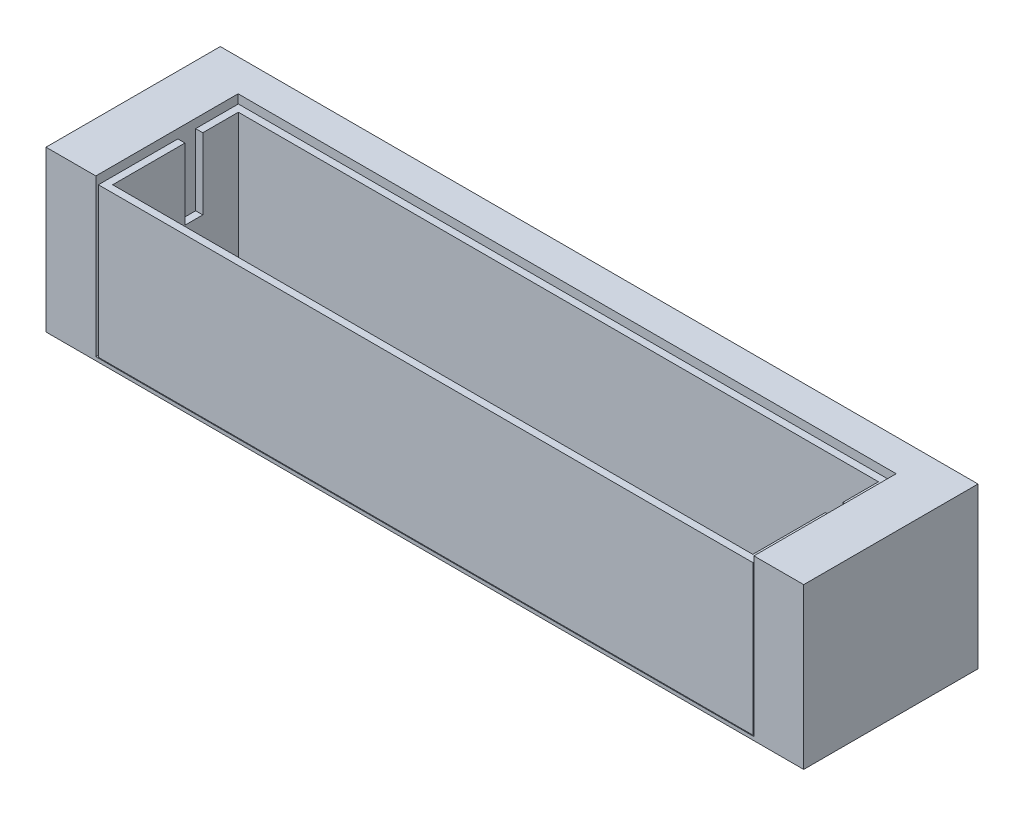
ISO-10303-21;
HEADER;
FILE_DESCRIPTION(('STEP AP214'),'2;1');
FILE_NAME('part.step','',(''),(''),'','','');
FILE_SCHEMA(('AUTOMOTIVE_DESIGN { 1 0 10303 214 1 1 1 1 }'));
ENDSEC;
DATA;
#1=APPLICATION_CONTEXT('core data for automotive mechanical design processes');
#2=APPLICATION_PROTOCOL_DEFINITION('international standard','automotive_design',2000,#1);
#3=PRODUCT_CONTEXT('',#1,'mechanical');
#4=PRODUCT('Part','Part','',(#3));
#5=PRODUCT_RELATED_PRODUCT_CATEGORY('part','',(#4));
#6=PRODUCT_DEFINITION_FORMATION('','',#4);
#7=PRODUCT_DEFINITION_CONTEXT('part definition',#1,'design');
#8=PRODUCT_DEFINITION('design','',#6,#7);
#9=PRODUCT_DEFINITION_SHAPE('','',#8);
#10=(LENGTH_UNIT() NAMED_UNIT(*) SI_UNIT(.MILLI.,.METRE.));
#11=(NAMED_UNIT(*) PLANE_ANGLE_UNIT() SI_UNIT($,.RADIAN.));
#12=(NAMED_UNIT(*) SI_UNIT($,.STERADIAN.) SOLID_ANGLE_UNIT());
#13=UNCERTAINTY_MEASURE_WITH_UNIT(LENGTH_MEASURE(1.E-05),#10,'distance_accuracy_value','');
#14=(GEOMETRIC_REPRESENTATION_CONTEXT(3) GLOBAL_UNCERTAINTY_ASSIGNED_CONTEXT((#13)) GLOBAL_UNIT_ASSIGNED_CONTEXT((#10,
#11,#12)) REPRESENTATION_CONTEXT('',''));
#15=CARTESIAN_POINT('',(0.,0.,0.));
#16=DIRECTION('',(0.,0.,1.));
#17=DIRECTION('',(1.,0.,0.));
#18=AXIS2_PLACEMENT_3D('',#15,#16,#17);
#19=CARTESIAN_POINT('',(-9.00781996408617,18.5,4.3850582673517));
#20=DIRECTION('',(0.,1.,0.));
#21=DIRECTION('',(0.,0.,1.));
#22=AXIS2_PLACEMENT_3D('',#19,#20,#21);
#23=PLANE('',#22);
#24=DIRECTION('',(0.,0.,1.));
#25=VECTOR('',#24,1.);
#26=CARTESIAN_POINT('',(8.99781996408616,18.5,4.3850582673517));
#27=LINE('',#26,#25);
#28=CARTESIAN_POINT('',(8.99781996408616,18.5,4.3950582673517));
#29=VERTEX_POINT('',#28);
#30=CARTESIAN_POINT('',(8.99781996408616,18.5,7.92813548410465));
#31=VERTEX_POINT('',#30);
#32=EDGE_CURVE('E188',#29,#31,#27,.T.);
#33=ORIENTED_EDGE('',*,*,#32,.F.);
#34=DIRECTION('',(1.,0.,0.));
#35=VECTOR('',#34,1.);
#36=CARTESIAN_POINT('',(-9.00781996408616,18.5,4.3950582673517));
#37=LINE('',#36,#35);
#38=CARTESIAN_POINT('',(-8.99781996408617,18.5,4.3950582673517));
#39=VERTEX_POINT('',#38);
#40=EDGE_CURVE('E20',#39,#29,#37,.T.);
#41=ORIENTED_EDGE('',*,*,#40,.F.);
#42=DIRECTION('',(0.,0.,-1.));
#43=VECTOR('',#42,1.);
#44=CARTESIAN_POINT('',(-8.99781996408617,18.5,7.93813548410465));
#45=LINE('',#44,#43);
#46=CARTESIAN_POINT('',(-8.99781996408617,18.5,7.92813548410465));
#47=VERTEX_POINT('',#46);
#48=EDGE_CURVE('E200',#47,#39,#45,.T.);
#49=ORIENTED_EDGE('',*,*,#48,.F.);
#50=DIRECTION('',(-1.,0.,0.));
#51=VECTOR('',#50,1.);
#52=CARTESIAN_POINT('',(9.00781996408616,18.5,7.92813548410465));
#53=LINE('',#52,#51);
#54=EDGE_CURVE('E176',#31,#47,#53,.T.);
#55=ORIENTED_EDGE('',*,*,#54,.F.);
#56=EDGE_LOOP('',(#33,#41,#49,#55));
#57=FACE_BOUND('',#56,.T.);
#58=ADVANCED_FACE('F17',(#57),#23,.T.);
#59=CARTESIAN_POINT('',(-9.00781996408616,18.49,4.3950582673517));
#60=DIRECTION('',(0.,0.,1.));
#61=DIRECTION('',(1.,0.,0.));
#62=AXIS2_PLACEMENT_3D('',#59,#60,#61);
#63=PLANE('',#62);
#64=DIRECTION('',(1.,0.,0.));
#65=VECTOR('',#64,1.);
#66=CARTESIAN_POINT('',(-9.20781996408616,22.5,4.3950582673517));
#67=LINE('',#66,#65);
#68=CARTESIAN_POINT('',(-8.99781996408617,22.5,4.3950582673517));
#69=VERTEX_POINT('',#68);
#70=CARTESIAN_POINT('',(8.99781996408616,22.5,4.3950582673517));
#71=VERTEX_POINT('',#70);
#72=EDGE_CURVE('E223',#69,#71,#67,.T.);
#73=ORIENTED_EDGE('',*,*,#72,.F.);
#74=DIRECTION('',(0.,1.,0.));
#75=VECTOR('',#74,1.);
#76=CARTESIAN_POINT('',(-8.99781996408617,18.49,4.3950582673517));
#77=LINE('',#76,#75);
#78=EDGE_CURVE('E186',#39,#69,#77,.T.);
#79=ORIENTED_EDGE('',*,*,#78,.F.);
#80=ORIENTED_EDGE('',*,*,#40,.T.);
#81=DIRECTION('',(0.,1.,0.));
#82=VECTOR('',#81,1.);
#83=CARTESIAN_POINT('',(8.99781996408616,18.49,4.3950582673517));
#84=LINE('',#83,#82);
#85=EDGE_CURVE('E184',#71,#29,#84,.F.);
#86=ORIENTED_EDGE('',*,*,#85,.F.);
#87=EDGE_LOOP('',(#73,#79,#80,#86));
#88=FACE_BOUND('',#87,.T.);
#89=ADVANCED_FACE('F182',(#88),#63,.T.);
#90=CARTESIAN_POINT('',(8.99781996408616,18.49,4.3850582673517));
#91=DIRECTION('',(-1.,0.,0.));
#92=DIRECTION('',(0.,0.,1.));
#93=AXIS2_PLACEMENT_3D('',#90,#91,#92);
#94=PLANE('',#93);
#95=ORIENTED_EDGE('',*,*,#32,.T.);
#96=DIRECTION('',(0.,1.,0.));
#97=VECTOR('',#96,1.);
#98=CARTESIAN_POINT('',(8.99781996408616,18.49,7.92813548410465));
#99=LINE('',#98,#97);
#100=CARTESIAN_POINT('',(8.99781996408616,22.5,7.92813548410465));
#101=VERTEX_POINT('',#100);
#102=EDGE_CURVE('E198',#101,#31,#99,.F.);
#103=ORIENTED_EDGE('',*,*,#102,.F.);
#104=DIRECTION('',(0.,0.,1.));
#105=VECTOR('',#104,1.);
#106=CARTESIAN_POINT('',(8.99781996408616,22.5,5.8850582673517));
#107=LINE('',#106,#105);
#108=CARTESIAN_POINT('',(8.99781996408616,22.5,5.8950582673517));
#109=VERTEX_POINT('',#108);
#110=EDGE_CURVE('E249',#109,#101,#107,.T.);
#111=ORIENTED_EDGE('',*,*,#110,.F.);
#112=DIRECTION('',(0.,1.,0.));
#113=VECTOR('',#112,1.);
#114=CARTESIAN_POINT('',(8.99781996408616,20.49,5.8950582673517));
#115=LINE('',#114,#113);
#116=CARTESIAN_POINT('',(8.99781996408616,20.5,5.8950582673517));
#117=VERTEX_POINT('',#116);
#118=EDGE_CURVE('E244',#117,#109,#115,.T.);
#119=ORIENTED_EDGE('',*,*,#118,.F.);
#120=DIRECTION('',(0.,0.,1.));
#121=VECTOR('',#120,1.);
#122=CARTESIAN_POINT('',(8.99781996408616,20.5,5.3850582673517));
#123=LINE('',#122,#121);
#124=CARTESIAN_POINT('',(8.99781996408616,20.5,5.3950582673517));
#125=VERTEX_POINT('',#124);
#126=EDGE_CURVE('E239',#125,#117,#123,.T.);
#127=ORIENTED_EDGE('',*,*,#126,.F.);
#128=DIRECTION('',(0.,1.,0.));
#129=VECTOR('',#128,1.);
#130=CARTESIAN_POINT('',(8.99781996408616,20.49,5.3950582673517));
#131=LINE('',#130,#129);
#132=CARTESIAN_POINT('',(8.99781996408616,22.5,5.3950582673517));
#133=VERTEX_POINT('',#132);
#134=EDGE_CURVE('E234',#133,#125,#131,.F.);
#135=ORIENTED_EDGE('',*,*,#134,.F.);
#136=DIRECTION('',(0.,0.,1.));
#137=VECTOR('',#136,1.);
#138=CARTESIAN_POINT('',(8.99781996408616,22.5,4.1850582673517));
#139=LINE('',#138,#137);
#140=EDGE_CURVE('E194',#71,#133,#139,.T.);
#141=ORIENTED_EDGE('',*,*,#140,.F.);
#142=ORIENTED_EDGE('',*,*,#85,.T.);
#143=EDGE_LOOP('',(#95,#103,#111,#119,#127,#135,#141,#142));
#144=FACE_BOUND('',#143,.T.);
#145=ADVANCED_FACE('F192',(#144),#94,.T.);
#146=CARTESIAN_POINT('',(9.00781996408616,18.49,7.92813548410465));
#147=DIRECTION('',(0.,0.,-1.));
#148=DIRECTION('',(-1.,0.,0.));
#149=AXIS2_PLACEMENT_3D('',#146,#147,#148);
#150=PLANE('',#149);
#151=DIRECTION('',(1.,0.,0.));
#152=VECTOR('',#151,1.);
#153=CARTESIAN_POINT('',(-9.20781996408616,22.5,7.92813548410465));
#154=LINE('',#153,#152);
#155=CARTESIAN_POINT('',(-8.99781996408617,22.5,7.92813548410465));
#156=VERTEX_POINT('',#155);
#157=EDGE_CURVE('E252',#101,#156,#154,.F.);
#158=ORIENTED_EDGE('',*,*,#157,.F.);
#159=ORIENTED_EDGE('',*,*,#102,.T.);
#160=ORIENTED_EDGE('',*,*,#54,.T.);
#161=DIRECTION('',(0.,1.,0.));
#162=VECTOR('',#161,1.);
#163=CARTESIAN_POINT('',(-8.99781996408617,18.49,7.92813548410465));
#164=LINE('',#163,#162);
#165=EDGE_CURVE('E203',#156,#47,#164,.F.);
#166=ORIENTED_EDGE('',*,*,#165,.F.);
#167=EDGE_LOOP('',(#158,#159,#160,#166));
#168=FACE_BOUND('',#167,.T.);
#169=ADVANCED_FACE('F481',(#168),#150,.T.);
#170=CARTESIAN_POINT('',(-8.99781996408617,18.49,7.93813548410465));
#171=DIRECTION('',(1.,0.,0.));
#172=DIRECTION('',(0.,0.,-1.));
#173=AXIS2_PLACEMENT_3D('',#170,#171,#172);
#174=PLANE('',#173);
#175=DIRECTION('',(0.,0.,1.));
#176=VECTOR('',#175,1.);
#177=CARTESIAN_POINT('',(-8.99781996408617,22.5,5.8850582673517));
#178=LINE('',#177,#176);
#179=CARTESIAN_POINT('',(-8.99781996408617,22.5,5.8950582673517));
#180=VERTEX_POINT('',#179);
#181=EDGE_CURVE('E255',#156,#180,#178,.F.);
#182=ORIENTED_EDGE('',*,*,#181,.F.);
#183=ORIENTED_EDGE('',*,*,#165,.T.);
#184=ORIENTED_EDGE('',*,*,#48,.T.);
#185=ORIENTED_EDGE('',*,*,#78,.T.);
#186=DIRECTION('',(0.,0.,1.));
#187=VECTOR('',#186,1.);
#188=CARTESIAN_POINT('',(-8.99781996408617,22.5,4.1850582673517));
#189=LINE('',#188,#187);
#190=CARTESIAN_POINT('',(-8.99781996408617,22.5,5.3950582673517));
#191=VERTEX_POINT('',#190);
#192=EDGE_CURVE('E220',#191,#69,#189,.F.);
#193=ORIENTED_EDGE('',*,*,#192,.F.);
#194=DIRECTION('',(0.,1.,0.));
#195=VECTOR('',#194,1.);
#196=CARTESIAN_POINT('',(-8.99781996408617,20.49,5.3950582673517));
#197=LINE('',#196,#195);
#198=CARTESIAN_POINT('',(-8.99781996408617,20.5,5.3950582673517));
#199=VERTEX_POINT('',#198);
#200=EDGE_CURVE('E217',#199,#191,#197,.T.);
#201=ORIENTED_EDGE('',*,*,#200,.F.);
#202=DIRECTION('',(0.,0.,1.));
#203=VECTOR('',#202,1.);
#204=CARTESIAN_POINT('',(-8.99781996408617,20.5,5.3850582673517));
#205=LINE('',#204,#203);
#206=CARTESIAN_POINT('',(-8.99781996408617,20.5,5.8950582673517));
#207=VERTEX_POINT('',#206);
#208=EDGE_CURVE('E209',#207,#199,#205,.F.);
#209=ORIENTED_EDGE('',*,*,#208,.F.);
#210=DIRECTION('',(0.,1.,0.));
#211=VECTOR('',#210,1.);
#212=CARTESIAN_POINT('',(-8.99781996408617,20.49,5.8950582673517));
#213=LINE('',#212,#211);
#214=EDGE_CURVE('E206',#180,#207,#213,.F.);
#215=ORIENTED_EDGE('',*,*,#214,.F.);
#216=EDGE_LOOP('',(#182,#183,#184,#185,#193,#201,#209,#215));
#217=FACE_BOUND('',#216,.T.);
#218=ADVANCED_FACE('F477',(#217),#174,.T.);
#219=CARTESIAN_POINT('',(-8.98781996408616,20.49,5.8950582673517));
#220=DIRECTION('',(0.,0.,-1.));
#221=DIRECTION('',(-1.,0.,0.));
#222=AXIS2_PLACEMENT_3D('',#219,#220,#221);
#223=PLANE('',#222);
#224=DIRECTION('',(1.,0.,0.));
#225=VECTOR('',#224,1.);
#226=CARTESIAN_POINT('',(-9.20781996408616,22.5,5.8950582673517));
#227=LINE('',#226,#225);
#228=CARTESIAN_POINT('',(-9.19781996408616,22.5,5.8950582673517));
#229=VERTEX_POINT('',#228);
#230=EDGE_CURVE('E258',#180,#229,#227,.F.);
#231=ORIENTED_EDGE('',*,*,#230,.F.);
#232=ORIENTED_EDGE('',*,*,#214,.T.);
#233=DIRECTION('',(1.,0.,0.));
#234=VECTOR('',#233,1.);
#235=CARTESIAN_POINT('',(-9.20781996408616,20.5,5.8950582673517));
#236=LINE('',#235,#234);
#237=CARTESIAN_POINT('',(-9.19781996408616,20.5,5.8950582673517));
#238=VERTEX_POINT('',#237);
#239=EDGE_CURVE('E211',#238,#207,#236,.T.);
#240=ORIENTED_EDGE('',*,*,#239,.F.);
#241=DIRECTION('',(0.,1.,0.));
#242=VECTOR('',#241,1.);
#243=CARTESIAN_POINT('',(-9.19781996408616,18.29,5.8950582673517));
#244=LINE('',#243,#242);
#245=EDGE_CURVE('E266',#229,#238,#244,.F.);
#246=ORIENTED_EDGE('',*,*,#245,.F.);
#247=EDGE_LOOP('',(#231,#232,#240,#246));
#248=FACE_BOUND('',#247,.T.);
#249=ADVANCED_FACE('F473',(#248),#223,.T.);
#250=CARTESIAN_POINT('',(-9.20781996408616,20.5,5.3850582673517));
#251=DIRECTION('',(0.,1.,0.));
#252=DIRECTION('',(0.,0.,1.));
#253=AXIS2_PLACEMENT_3D('',#250,#251,#252);
#254=PLANE('',#253);
#255=DIRECTION('',(0.,0.,1.));
#256=VECTOR('',#255,1.);
#257=CARTESIAN_POINT('',(-9.19781996408616,20.5,4.1850582673517));
#258=LINE('',#257,#256);
#259=CARTESIAN_POINT('',(-9.19781996408616,20.5,5.3950582673517));
#260=VERTEX_POINT('',#259);
#261=EDGE_CURVE('E269',#238,#260,#258,.F.);
#262=ORIENTED_EDGE('',*,*,#261,.F.);
#263=ORIENTED_EDGE('',*,*,#239,.T.);
#264=ORIENTED_EDGE('',*,*,#208,.T.);
#265=DIRECTION('',(1.,0.,0.));
#266=VECTOR('',#265,1.);
#267=CARTESIAN_POINT('',(-9.20781996408616,20.5,5.3950582673517));
#268=LINE('',#267,#266);
#269=EDGE_CURVE('E214',#260,#199,#268,.T.);
#270=ORIENTED_EDGE('',*,*,#269,.F.);
#271=EDGE_LOOP('',(#262,#263,#264,#270));
#272=FACE_BOUND('',#271,.T.);
#273=ADVANCED_FACE('F469',(#272),#254,.T.);
#274=CARTESIAN_POINT('',(-9.20781996408616,20.49,5.3950582673517));
#275=DIRECTION('',(0.,0.,1.));
#276=DIRECTION('',(1.,0.,0.));
#277=AXIS2_PLACEMENT_3D('',#274,#275,#276);
#278=PLANE('',#277);
#279=DIRECTION('',(1.,0.,0.));
#280=VECTOR('',#279,1.);
#281=CARTESIAN_POINT('',(-9.20781996408616,22.5,5.3950582673517));
#282=LINE('',#281,#280);
#283=CARTESIAN_POINT('',(-9.19781996408616,22.5,5.3950582673517));
#284=VERTEX_POINT('',#283);
#285=EDGE_CURVE('E228',#284,#191,#282,.T.);
#286=ORIENTED_EDGE('',*,*,#285,.F.);
#287=DIRECTION('',(0.,1.,0.));
#288=VECTOR('',#287,1.);
#289=CARTESIAN_POINT('',(-9.19781996408616,18.29,5.3950582673517));
#290=LINE('',#289,#288);
#291=EDGE_CURVE('E272',#260,#284,#290,.T.);
#292=ORIENTED_EDGE('',*,*,#291,.F.);
#293=ORIENTED_EDGE('',*,*,#269,.T.);
#294=ORIENTED_EDGE('',*,*,#200,.T.);
#295=EDGE_LOOP('',(#286,#292,#293,#294));
#296=FACE_BOUND('',#295,.T.);
#297=ADVANCED_FACE('F465',(#296),#278,.T.);
#298=CARTESIAN_POINT('',(-9.20781996408616,22.5,4.1850582673517));
#299=DIRECTION('',(0.,1.,0.));
#300=DIRECTION('',(0.,0.,1.));
#301=AXIS2_PLACEMENT_3D('',#298,#299,#300);
#302=PLANE('',#301);
#303=DIRECTION('',(0.,0.,1.));
#304=VECTOR('',#303,1.);
#305=CARTESIAN_POINT('',(-9.19781996408616,22.5,4.1850582673517));
#306=LINE('',#305,#304);
#307=CARTESIAN_POINT('',(-9.19781996408616,22.5,4.1950582673517));
#308=VERTEX_POINT('',#307);
#309=EDGE_CURVE('E275',#284,#308,#306,.F.);
#310=ORIENTED_EDGE('',*,*,#309,.F.);
#311=ORIENTED_EDGE('',*,*,#285,.T.);
#312=ORIENTED_EDGE('',*,*,#192,.T.);
#313=ORIENTED_EDGE('',*,*,#72,.T.);
#314=ORIENTED_EDGE('',*,*,#140,.T.);
#315=DIRECTION('',(1.,0.,0.));
#316=VECTOR('',#315,1.);
#317=CARTESIAN_POINT('',(8.98781996408616,22.5,5.3950582673517));
#318=LINE('',#317,#316);
#319=CARTESIAN_POINT('',(9.19781996408616,22.5,5.3950582673517));
#320=VERTEX_POINT('',#319);
#321=EDGE_CURVE('E231',#320,#133,#318,.F.);
#322=ORIENTED_EDGE('',*,*,#321,.F.);
#323=DIRECTION('',(0.,0.,1.));
#324=VECTOR('',#323,1.);
#325=CARTESIAN_POINT('',(9.19781996408616,22.5,4.1850582673517));
#326=LINE('',#325,#324);
#327=CARTESIAN_POINT('',(9.19781996408616,22.5,4.1950582673517));
#328=VERTEX_POINT('',#327);
#329=EDGE_CURVE('E226',#320,#328,#326,.F.);
#330=ORIENTED_EDGE('',*,*,#329,.T.);
#331=DIRECTION('',(-1.,0.,0.));
#332=VECTOR('',#331,1.);
#333=CARTESIAN_POINT('',(9.20781996408616,22.5,4.1950582673517));
#334=LINE('',#333,#332);
#335=EDGE_CURVE('E281',#308,#328,#334,.F.);
#336=ORIENTED_EDGE('',*,*,#335,.F.);
#337=EDGE_LOOP('',(#310,#311,#312,#313,#314,#322,#330,#336));
#338=FACE_BOUND('',#337,.T.);
#339=ADVANCED_FACE('F461',(#338),#302,.T.);
#340=CARTESIAN_POINT('',(8.98781996408616,20.49,5.3950582673517));
#341=DIRECTION('',(0.,0.,1.));
#342=DIRECTION('',(1.,0.,0.));
#343=AXIS2_PLACEMENT_3D('',#340,#341,#342);
#344=PLANE('',#343);
#345=ORIENTED_EDGE('',*,*,#321,.T.);
#346=ORIENTED_EDGE('',*,*,#134,.T.);
#347=DIRECTION('',(1.,0.,0.));
#348=VECTOR('',#347,1.);
#349=CARTESIAN_POINT('',(8.98781996408616,20.5,5.3950582673517));
#350=LINE('',#349,#348);
#351=CARTESIAN_POINT('',(9.19781996408616,20.5,5.3950582673517));
#352=VERTEX_POINT('',#351);
#353=EDGE_CURVE('E236',#352,#125,#350,.F.);
#354=ORIENTED_EDGE('',*,*,#353,.F.);
#355=DIRECTION('',(0.,1.,0.));
#356=VECTOR('',#355,1.);
#357=CARTESIAN_POINT('',(9.19781996408616,18.29,5.3950582673517));
#358=LINE('',#357,#356);
#359=EDGE_CURVE('E290',#320,#352,#358,.F.);
#360=ORIENTED_EDGE('',*,*,#359,.F.);
#361=EDGE_LOOP('',(#345,#346,#354,#360));
#362=FACE_BOUND('',#361,.T.);
#363=ADVANCED_FACE('F457',(#362),#344,.T.);
#364=CARTESIAN_POINT('',(8.98781996408616,20.5,5.3850582673517));
#365=DIRECTION('',(0.,1.,0.));
#366=DIRECTION('',(0.,0.,1.));
#367=AXIS2_PLACEMENT_3D('',#364,#365,#366);
#368=PLANE('',#367);
#369=ORIENTED_EDGE('',*,*,#353,.T.);
#370=ORIENTED_EDGE('',*,*,#126,.T.);
#371=DIRECTION('',(-1.,0.,0.));
#372=VECTOR('',#371,1.);
#373=CARTESIAN_POINT('',(9.20781996408616,20.5,5.8950582673517));
#374=LINE('',#373,#372);
#375=CARTESIAN_POINT('',(9.19781996408616,20.5,5.8950582673517));
#376=VERTEX_POINT('',#375);
#377=EDGE_CURVE('E241',#376,#117,#374,.T.);
#378=ORIENTED_EDGE('',*,*,#377,.F.);
#379=DIRECTION('',(0.,0.,-1.));
#380=VECTOR('',#379,1.);
#381=CARTESIAN_POINT('',(9.19781996408616,20.5,8.13813548410465));
#382=LINE('',#381,#380);
#383=EDGE_CURVE('E293',#352,#376,#382,.F.);
#384=ORIENTED_EDGE('',*,*,#383,.F.);
#385=EDGE_LOOP('',(#369,#370,#378,#384));
#386=FACE_BOUND('',#385,.T.);
#387=ADVANCED_FACE('F453',(#386),#368,.T.);
#388=CARTESIAN_POINT('',(9.20781996408616,20.49,5.8950582673517));
#389=DIRECTION('',(0.,0.,-1.));
#390=DIRECTION('',(-1.,0.,0.));
#391=AXIS2_PLACEMENT_3D('',#388,#389,#390);
#392=PLANE('',#391);
#393=DIRECTION('',(1.,0.,0.));
#394=VECTOR('',#393,1.);
#395=CARTESIAN_POINT('',(-9.20781996408616,22.5,5.8950582673517));
#396=LINE('',#395,#394);
#397=CARTESIAN_POINT('',(9.19781996408616,22.5,5.8950582673517));
#398=VERTEX_POINT('',#397);
#399=EDGE_CURVE('E246',#398,#109,#396,.F.);
#400=ORIENTED_EDGE('',*,*,#399,.F.);
#401=DIRECTION('',(0.,1.,0.));
#402=VECTOR('',#401,1.);
#403=CARTESIAN_POINT('',(9.19781996408616,18.29,5.8950582673517));
#404=LINE('',#403,#402);
#405=EDGE_CURVE('E296',#376,#398,#404,.T.);
#406=ORIENTED_EDGE('',*,*,#405,.F.);
#407=ORIENTED_EDGE('',*,*,#377,.T.);
#408=ORIENTED_EDGE('',*,*,#118,.T.);
#409=EDGE_LOOP('',(#400,#406,#407,#408));
#410=FACE_BOUND('',#409,.T.);
#411=ADVANCED_FACE('F449',(#410),#392,.T.);
#412=CARTESIAN_POINT('',(-9.20781996408616,22.5,5.8850582673517));
#413=DIRECTION('',(0.,1.,0.));
#414=DIRECTION('',(0.,0.,1.));
#415=AXIS2_PLACEMENT_3D('',#412,#413,#414);
#416=PLANE('',#415);
#417=ORIENTED_EDGE('',*,*,#181,.T.);
#418=ORIENTED_EDGE('',*,*,#230,.T.);
#419=DIRECTION('',(0.,0.,1.));
#420=VECTOR('',#419,1.);
#421=CARTESIAN_POINT('',(-9.19781996408616,22.5,4.1850582673517));
#422=LINE('',#421,#420);
#423=CARTESIAN_POINT('',(-9.19781996408616,22.5,8.12813548410465));
#424=VERTEX_POINT('',#423);
#425=EDGE_CURVE('E263',#424,#229,#422,.F.);
#426=ORIENTED_EDGE('',*,*,#425,.F.);
#427=DIRECTION('',(1.,0.,0.));
#428=VECTOR('',#427,1.);
#429=CARTESIAN_POINT('',(-9.20781996408616,22.5,8.12813548410465));
#430=LINE('',#429,#428);
#431=CARTESIAN_POINT('',(9.19781996408616,22.5,8.12813548410465));
#432=VERTEX_POINT('',#431);
#433=EDGE_CURVE('E260',#432,#424,#430,.F.);
#434=ORIENTED_EDGE('',*,*,#433,.F.);
#435=DIRECTION('',(0.,0.,-1.));
#436=VECTOR('',#435,1.);
#437=CARTESIAN_POINT('',(9.19781996408616,22.5,8.13813548410465));
#438=LINE('',#437,#436);
#439=EDGE_CURVE('E299',#398,#432,#438,.F.);
#440=ORIENTED_EDGE('',*,*,#439,.F.);
#441=ORIENTED_EDGE('',*,*,#399,.T.);
#442=ORIENTED_EDGE('',*,*,#110,.T.);
#443=ORIENTED_EDGE('',*,*,#157,.T.);
#444=EDGE_LOOP('',(#417,#418,#426,#434,#440,#441,#442,#443));
#445=FACE_BOUND('',#444,.T.);
#446=ADVANCED_FACE('F445',(#445),#416,.T.);
#447=CARTESIAN_POINT('',(-9.20781996408616,18.29,8.12813548410465));
#448=DIRECTION('',(0.,0.,1.));
#449=DIRECTION('',(1.,0.,0.));
#450=AXIS2_PLACEMENT_3D('',#447,#448,#449);
#451=PLANE('',#450);
#452=DIRECTION('',(1.,0.,0.));
#453=VECTOR('',#452,1.);
#454=CARTESIAN_POINT('',(-9.26,18.3,8.12813548410465));
#455=LINE('',#454,#453);
#456=CARTESIAN_POINT('',(9.19781996408616,18.3,8.12813548410465));
#457=VERTEX_POINT('',#456);
#458=CARTESIAN_POINT('',(-9.19781996408616,18.3,8.12813548410465));
#459=VERTEX_POINT('',#458);
#460=EDGE_CURVE('E312',#457,#459,#455,.F.);
#461=ORIENTED_EDGE('',*,*,#460,.F.);
#462=DIRECTION('',(0.,1.,0.));
#463=VECTOR('',#462,1.);
#464=CARTESIAN_POINT('',(9.19781996408616,18.29,8.12813548410465));
#465=LINE('',#464,#463);
#466=EDGE_CURVE('E302',#432,#457,#465,.F.);
#467=ORIENTED_EDGE('',*,*,#466,.F.);
#468=ORIENTED_EDGE('',*,*,#433,.T.);
#469=DIRECTION('',(0.,1.,0.));
#470=VECTOR('',#469,1.);
#471=CARTESIAN_POINT('',(-9.19781996408616,18.29,8.12813548410465));
#472=LINE('',#471,#470);
#473=EDGE_CURVE('E278',#459,#424,#472,.T.);
#474=ORIENTED_EDGE('',*,*,#473,.F.);
#475=EDGE_LOOP('',(#461,#467,#468,#474));
#476=FACE_BOUND('',#475,.T.);
#477=ADVANCED_FACE('F441',(#476),#451,.T.);
#478=CARTESIAN_POINT('',(-9.19781996408616,18.29,4.1850582673517));
#479=DIRECTION('',(-1.,0.,0.));
#480=DIRECTION('',(0.,0.,1.));
#481=AXIS2_PLACEMENT_3D('',#478,#479,#480);
#482=PLANE('',#481);
#483=DIRECTION('',(0.,0.,1.));
#484=VECTOR('',#483,1.);
#485=CARTESIAN_POINT('',(-9.19781996408616,18.3,4.14));
#486=LINE('',#485,#484);
#487=CARTESIAN_POINT('',(-9.19781996408616,18.3,4.1950582673517));
#488=VERTEX_POINT('',#487);
#489=EDGE_CURVE('E315',#459,#488,#486,.F.);
#490=ORIENTED_EDGE('',*,*,#489,.F.);
#491=ORIENTED_EDGE('',*,*,#473,.T.);
#492=ORIENTED_EDGE('',*,*,#425,.T.);
#493=ORIENTED_EDGE('',*,*,#245,.T.);
#494=ORIENTED_EDGE('',*,*,#261,.T.);
#495=ORIENTED_EDGE('',*,*,#291,.T.);
#496=ORIENTED_EDGE('',*,*,#309,.T.);
#497=DIRECTION('',(0.,1.,0.));
#498=VECTOR('',#497,1.);
#499=CARTESIAN_POINT('',(-9.19781996408616,18.29,4.1950582673517));
#500=LINE('',#499,#498);
#501=EDGE_CURVE('E284',#488,#308,#500,.T.);
#502=ORIENTED_EDGE('',*,*,#501,.F.);
#503=EDGE_LOOP('',(#490,#491,#492,#493,#494,#495,#496,#502));
#504=FACE_BOUND('',#503,.T.);
#505=ADVANCED_FACE('F437',(#504),#482,.T.);
#506=CARTESIAN_POINT('',(9.20781996408616,18.29,4.1950582673517));
#507=DIRECTION('',(0.,0.,-1.));
#508=DIRECTION('',(-1.,0.,0.));
#509=AXIS2_PLACEMENT_3D('',#506,#507,#508);
#510=PLANE('',#509);
#511=DIRECTION('',(1.,0.,0.));
#512=VECTOR('',#511,1.);
#513=CARTESIAN_POINT('',(-9.26,18.3,4.1950582673517));
#514=LINE('',#513,#512);
#515=CARTESIAN_POINT('',(9.19781996408616,18.3,4.1950582673517));
#516=VERTEX_POINT('',#515);
#517=EDGE_CURVE('E318',#488,#516,#514,.T.);
#518=ORIENTED_EDGE('',*,*,#517,.F.);
#519=ORIENTED_EDGE('',*,*,#501,.T.);
#520=ORIENTED_EDGE('',*,*,#335,.T.);
#521=DIRECTION('',(0.,1.,0.));
#522=VECTOR('',#521,1.);
#523=CARTESIAN_POINT('',(9.19781996408616,18.29,4.1950582673517));
#524=LINE('',#523,#522);
#525=EDGE_CURVE('E287',#516,#328,#524,.T.);
#526=ORIENTED_EDGE('',*,*,#525,.F.);
#527=EDGE_LOOP('',(#518,#519,#520,#526));
#528=FACE_BOUND('',#527,.T.);
#529=ADVANCED_FACE('F433',(#528),#510,.T.);
#530=CARTESIAN_POINT('',(9.19781996408616,18.29,8.13813548410465));
#531=DIRECTION('',(1.,0.,0.));
#532=DIRECTION('',(0.,0.,-1.));
#533=AXIS2_PLACEMENT_3D('',#530,#531,#532);
#534=PLANE('',#533);
#535=ORIENTED_EDGE('',*,*,#439,.T.);
#536=ORIENTED_EDGE('',*,*,#466,.T.);
#537=DIRECTION('',(0.,0.,1.));
#538=VECTOR('',#537,1.);
#539=CARTESIAN_POINT('',(9.19781996408616,18.3,4.14));
#540=LINE('',#539,#538);
#541=EDGE_CURVE('E321',#516,#457,#540,.T.);
#542=ORIENTED_EDGE('',*,*,#541,.F.);
#543=ORIENTED_EDGE('',*,*,#525,.T.);
#544=ORIENTED_EDGE('',*,*,#329,.F.);
#545=ORIENTED_EDGE('',*,*,#359,.T.);
#546=ORIENTED_EDGE('',*,*,#383,.T.);
#547=ORIENTED_EDGE('',*,*,#405,.T.);
#548=EDGE_LOOP('',(#535,#536,#542,#543,#544,#545,#546,#547));
#549=FACE_BOUND('',#548,.T.);
#550=ADVANCED_FACE('F430',(#549),#534,.T.);
#551=CARTESIAN_POINT('',(-9.26,18.29,4.15));
#552=DIRECTION('',(0.,0.,1.));
#553=DIRECTION('',(1.,0.,0.));
#554=AXIS2_PLACEMENT_3D('',#551,#552,#553);
#555=PLANE('',#554);
#556=DIRECTION('',(1.,0.,0.));
#557=VECTOR('',#556,1.);
#558=CARTESIAN_POINT('',(-10.66,22.7,4.15));
#559=LINE('',#558,#557);
#560=CARTESIAN_POINT('',(-9.25,22.7,4.15));
#561=VERTEX_POINT('',#560);
#562=CARTESIAN_POINT('',(9.25,22.7,4.15));
#563=VERTEX_POINT('',#562);
#564=EDGE_CURVE('E332',#561,#563,#559,.T.);
#565=ORIENTED_EDGE('',*,*,#564,.F.);
#566=DIRECTION('',(0.,1.,0.));
#567=VECTOR('',#566,1.);
#568=CARTESIAN_POINT('',(-9.25,18.29,4.15));
#569=LINE('',#568,#567);
#570=CARTESIAN_POINT('',(-9.25,18.3,4.15));
#571=VERTEX_POINT('',#570);
#572=EDGE_CURVE('E327',#571,#561,#569,.T.);
#573=ORIENTED_EDGE('',*,*,#572,.F.);
#574=DIRECTION('',(1.,0.,0.));
#575=VECTOR('',#574,1.);
#576=CARTESIAN_POINT('',(-9.26,18.3,4.15));
#577=LINE('',#576,#575);
#578=CARTESIAN_POINT('',(9.25,18.3,4.15));
#579=VERTEX_POINT('',#578);
#580=EDGE_CURVE('E310',#579,#571,#577,.F.);
#581=ORIENTED_EDGE('',*,*,#580,.F.);
#582=DIRECTION('',(0.,1.,0.));
#583=VECTOR('',#582,1.);
#584=CARTESIAN_POINT('',(9.25,18.29,4.15));
#585=LINE('',#584,#583);
#586=EDGE_CURVE('E305',#563,#579,#585,.F.);
#587=ORIENTED_EDGE('',*,*,#586,.F.);
#588=EDGE_LOOP('',(#565,#573,#581,#587));
#589=FACE_BOUND('',#588,.T.);
#590=ADVANCED_FACE('F397',(#589),#555,.T.);
#591=CARTESIAN_POINT('',(9.25,18.29,4.14));
#592=DIRECTION('',(-1.,0.,0.));
#593=DIRECTION('',(0.,0.,1.));
#594=AXIS2_PLACEMENT_3D('',#591,#592,#593);
#595=PLANE('',#594);
#596=DIRECTION('',(0.,0.,1.));
#597=VECTOR('',#596,1.);
#598=CARTESIAN_POINT('',(9.25,22.7,3.24));
#599=LINE('',#598,#597);
#600=CARTESIAN_POINT('',(9.25,22.7,8.15));
#601=VERTEX_POINT('',#600);
#602=EDGE_CURVE('E335',#563,#601,#599,.T.);
#603=ORIENTED_EDGE('',*,*,#602,.F.);
#604=ORIENTED_EDGE('',*,*,#586,.T.);
#605=DIRECTION('',(0.,0.,1.));
#606=VECTOR('',#605,1.);
#607=CARTESIAN_POINT('',(9.25,18.3,4.14));
#608=LINE('',#607,#606);
#609=CARTESIAN_POINT('',(9.25,18.3,8.15));
#610=VERTEX_POINT('',#609);
#611=EDGE_CURVE('E307',#610,#579,#608,.F.);
#612=ORIENTED_EDGE('',*,*,#611,.F.);
#613=DIRECTION('',(0.,1.,0.));
#614=VECTOR('',#613,1.);
#615=CARTESIAN_POINT('',(9.25,18.19,8.15));
#616=LINE('',#615,#614);
#617=EDGE_CURVE('E340',#601,#610,#616,.F.);
#618=ORIENTED_EDGE('',*,*,#617,.F.);
#619=EDGE_LOOP('',(#603,#604,#612,#618));
#620=FACE_BOUND('',#619,.T.);
#621=ADVANCED_FACE('F400',(#620),#595,.T.);
#622=CARTESIAN_POINT('',(-9.26,18.3,4.14));
#623=DIRECTION('',(0.,1.,0.));
#624=DIRECTION('',(0.,0.,1.));
#625=AXIS2_PLACEMENT_3D('',#622,#623,#624);
#626=PLANE('',#625);
#627=ORIENTED_EDGE('',*,*,#517,.T.);
#628=ORIENTED_EDGE('',*,*,#541,.T.);
#629=ORIENTED_EDGE('',*,*,#460,.T.);
#630=ORIENTED_EDGE('',*,*,#489,.T.);
#631=EDGE_LOOP('',(#627,#628,#629,#630));
#632=FACE_BOUND('',#631,.T.);
#633=ORIENTED_EDGE('',*,*,#611,.T.);
#634=ORIENTED_EDGE('',*,*,#580,.T.);
#635=DIRECTION('',(0.,0.,-1.));
#636=VECTOR('',#635,1.);
#637=CARTESIAN_POINT('',(-9.25,18.3,8.16));
#638=LINE('',#637,#636);
#639=CARTESIAN_POINT('',(-9.25,18.3,8.15));
#640=VERTEX_POINT('',#639);
#641=EDGE_CURVE('E324',#640,#571,#638,.T.);
#642=ORIENTED_EDGE('',*,*,#641,.F.);
#643=DIRECTION('',(1.,0.,0.));
#644=VECTOR('',#643,1.);
#645=CARTESIAN_POINT('',(-10.66,18.3,8.15));
#646=LINE('',#645,#644);
#647=EDGE_CURVE('E343',#610,#640,#646,.F.);
#648=ORIENTED_EDGE('',*,*,#647,.F.);
#649=EDGE_LOOP('',(#633,#634,#642,#648));
#650=FACE_BOUND('',#649,.T.);
#651=ADVANCED_FACE('F422',(#632,#650),#626,.T.);
#652=CARTESIAN_POINT('',(-9.25,18.29,8.16));
#653=DIRECTION('',(1.,0.,0.));
#654=DIRECTION('',(0.,0.,-1.));
#655=AXIS2_PLACEMENT_3D('',#652,#653,#654);
#656=PLANE('',#655);
#657=DIRECTION('',(0.,0.,1.));
#658=VECTOR('',#657,1.);
#659=CARTESIAN_POINT('',(-9.25,22.7,3.24));
#660=LINE('',#659,#658);
#661=CARTESIAN_POINT('',(-9.25,22.7,8.15));
#662=VERTEX_POINT('',#661);
#663=EDGE_CURVE('E329',#662,#561,#660,.F.);
#664=ORIENTED_EDGE('',*,*,#663,.F.);
#665=DIRECTION('',(0.,1.,0.));
#666=VECTOR('',#665,1.);
#667=CARTESIAN_POINT('',(-9.25,18.19,8.15));
#668=LINE('',#667,#666);
#669=EDGE_CURVE('E346',#640,#662,#668,.T.);
#670=ORIENTED_EDGE('',*,*,#669,.F.);
#671=ORIENTED_EDGE('',*,*,#641,.T.);
#672=ORIENTED_EDGE('',*,*,#572,.T.);
#673=EDGE_LOOP('',(#664,#670,#671,#672));
#674=FACE_BOUND('',#673,.T.);
#675=ADVANCED_FACE('F391',(#674),#656,.T.);
#676=CARTESIAN_POINT('',(-10.66,22.7,3.24));
#677=DIRECTION('',(0.,1.,0.));
#678=DIRECTION('',(0.,0.,1.));
#679=AXIS2_PLACEMENT_3D('',#676,#677,#678);
#680=PLANE('',#679);
#681=DIRECTION('',(-1.,0.,0.));
#682=VECTOR('',#681,1.);
#683=CARTESIAN_POINT('',(10.66,22.7,3.25));
#684=LINE('',#683,#682);
#685=CARTESIAN_POINT('',(-10.65,22.7,3.25));
#686=VERTEX_POINT('',#685);
#687=CARTESIAN_POINT('',(10.65,22.7,3.25));
#688=VERTEX_POINT('',#687);
#689=EDGE_CURVE('E358',#686,#688,#684,.F.);
#690=ORIENTED_EDGE('',*,*,#689,.F.);
#691=DIRECTION('',(0.,0.,1.));
#692=VECTOR('',#691,1.);
#693=CARTESIAN_POINT('',(-10.65,22.7,3.24));
#694=LINE('',#693,#692);
#695=CARTESIAN_POINT('',(-10.65,22.7,8.15));
#696=VERTEX_POINT('',#695);
#697=EDGE_CURVE('E352',#696,#686,#694,.F.);
#698=ORIENTED_EDGE('',*,*,#697,.F.);
#699=DIRECTION('',(1.,0.,0.));
#700=VECTOR('',#699,1.);
#701=CARTESIAN_POINT('',(-10.66,22.7,8.15));
#702=LINE('',#701,#700);
#703=EDGE_CURVE('E349',#662,#696,#702,.F.);
#704=ORIENTED_EDGE('',*,*,#703,.F.);
#705=ORIENTED_EDGE('',*,*,#663,.T.);
#706=ORIENTED_EDGE('',*,*,#564,.T.);
#707=ORIENTED_EDGE('',*,*,#602,.T.);
#708=DIRECTION('',(1.,0.,0.));
#709=VECTOR('',#708,1.);
#710=CARTESIAN_POINT('',(-10.66,22.7,8.15));
#711=LINE('',#710,#709);
#712=CARTESIAN_POINT('',(10.65,22.7,8.15));
#713=VERTEX_POINT('',#712);
#714=EDGE_CURVE('E337',#713,#601,#711,.F.);
#715=ORIENTED_EDGE('',*,*,#714,.F.);
#716=DIRECTION('',(0.,0.,-1.));
#717=VECTOR('',#716,1.);
#718=CARTESIAN_POINT('',(10.65,22.7,8.16));
#719=LINE('',#718,#717);
#720=EDGE_CURVE('E363',#688,#713,#719,.F.);
#721=ORIENTED_EDGE('',*,*,#720,.F.);
#722=EDGE_LOOP('',(#690,#698,#704,#705,#706,#707,#715,#721));
#723=FACE_BOUND('',#722,.T.);
#724=ADVANCED_FACE('F385',(#723),#680,.T.);
#725=CARTESIAN_POINT('',(-10.66,18.19,8.15));
#726=DIRECTION('',(0.,0.,1.));
#727=DIRECTION('',(1.,0.,0.));
#728=AXIS2_PLACEMENT_3D('',#725,#726,#727);
#729=PLANE('',#728);
#730=ORIENTED_EDGE('',*,*,#703,.T.);
#731=DIRECTION('',(0.,1.,0.));
#732=VECTOR('',#731,1.);
#733=CARTESIAN_POINT('',(-10.65,18.19,8.15));
#734=LINE('',#733,#732);
#735=CARTESIAN_POINT('',(-10.65,18.2,8.15));
#736=VERTEX_POINT('',#735);
#737=EDGE_CURVE('E355',#736,#696,#734,.T.);
#738=ORIENTED_EDGE('',*,*,#737,.F.);
#739=DIRECTION('',(1.,0.,0.));
#740=VECTOR('',#739,1.);
#741=CARTESIAN_POINT('',(-10.65,18.2,8.15));
#742=LINE('',#741,#740);
#743=CARTESIAN_POINT('',(10.65,18.2,8.15));
#744=VERTEX_POINT('',#743);
#745=EDGE_CURVE('E370',#744,#736,#742,.F.);
#746=ORIENTED_EDGE('',*,*,#745,.F.);
#747=DIRECTION('',(0.,1.,0.));
#748=VECTOR('',#747,1.);
#749=CARTESIAN_POINT('',(10.65,18.19,8.15));
#750=LINE('',#749,#748);
#751=EDGE_CURVE('E366',#713,#744,#750,.F.);
#752=ORIENTED_EDGE('',*,*,#751,.F.);
#753=ORIENTED_EDGE('',*,*,#714,.T.);
#754=ORIENTED_EDGE('',*,*,#617,.T.);
#755=ORIENTED_EDGE('',*,*,#647,.T.);
#756=ORIENTED_EDGE('',*,*,#669,.T.);
#757=EDGE_LOOP('',(#730,#738,#746,#752,#753,#754,#755,#756));
#758=FACE_BOUND('',#757,.T.);
#759=ADVANCED_FACE('F387',(#758),#729,.T.);
#760=CARTESIAN_POINT('',(-10.65,18.19,3.24));
#761=DIRECTION('',(-1.,0.,0.));
#762=DIRECTION('',(0.,0.,1.));
#763=AXIS2_PLACEMENT_3D('',#760,#761,#762);
#764=PLANE('',#763);
#765=DIRECTION('',(0.,0.,-1.));
#766=VECTOR('',#765,1.);
#767=CARTESIAN_POINT('',(-10.65,18.2,8.15000039523615));
#768=LINE('',#767,#766);
#769=CARTESIAN_POINT('',(-10.65,18.2,3.25));
#770=VERTEX_POINT('',#769);
#771=EDGE_CURVE('E373',#736,#770,#768,.T.);
#772=ORIENTED_EDGE('',*,*,#771,.F.);
#773=ORIENTED_EDGE('',*,*,#737,.T.);
#774=ORIENTED_EDGE('',*,*,#697,.T.);
#775=DIRECTION('',(0.,1.,0.));
#776=VECTOR('',#775,1.);
#777=CARTESIAN_POINT('',(-10.65,18.19,3.25));
#778=LINE('',#777,#776);
#779=EDGE_CURVE('E360',#770,#686,#778,.T.);
#780=ORIENTED_EDGE('',*,*,#779,.F.);
#781=EDGE_LOOP('',(#772,#773,#774,#780));
#782=FACE_BOUND('',#781,.T.);
#783=ADVANCED_FACE('F382',(#782),#764,.T.);
#784=CARTESIAN_POINT('',(10.66,18.19,3.25));
#785=DIRECTION('',(0.,0.,-1.));
#786=DIRECTION('',(-1.,0.,0.));
#787=AXIS2_PLACEMENT_3D('',#784,#785,#786);
#788=PLANE('',#787);
#789=DIRECTION('',(1.,0.,0.));
#790=VECTOR('',#789,1.);
#791=CARTESIAN_POINT('',(-10.65,18.2,3.25));
#792=LINE('',#791,#790);
#793=CARTESIAN_POINT('',(10.65,18.2,3.25));
#794=VERTEX_POINT('',#793);
#795=EDGE_CURVE('E26',#770,#794,#792,.T.);
#796=ORIENTED_EDGE('',*,*,#795,.F.);
#797=ORIENTED_EDGE('',*,*,#779,.T.);
#798=ORIENTED_EDGE('',*,*,#689,.T.);
#799=DIRECTION('',(0.,1.,0.));
#800=VECTOR('',#799,1.);
#801=CARTESIAN_POINT('',(10.65,18.19,3.25));
#802=LINE('',#801,#800);
#803=EDGE_CURVE('E35',#794,#688,#802,.T.);
#804=ORIENTED_EDGE('',*,*,#803,.F.);
#805=EDGE_LOOP('',(#796,#797,#798,#804));
#806=FACE_BOUND('',#805,.T.);
#807=ADVANCED_FACE('F380',(#806),#788,.T.);
#808=CARTESIAN_POINT('',(10.65,18.19,8.16));
#809=DIRECTION('',(1.,0.,0.));
#810=DIRECTION('',(0.,0.,-1.));
#811=AXIS2_PLACEMENT_3D('',#808,#809,#810);
#812=PLANE('',#811);
#813=DIRECTION('',(0.,0.,-1.));
#814=VECTOR('',#813,1.);
#815=CARTESIAN_POINT('',(10.65,18.2,8.15000039523615));
#816=LINE('',#815,#814);
#817=EDGE_CURVE('E11',#794,#744,#816,.F.);
#818=ORIENTED_EDGE('',*,*,#817,.F.);
#819=ORIENTED_EDGE('',*,*,#803,.T.);
#820=ORIENTED_EDGE('',*,*,#720,.T.);
#821=ORIENTED_EDGE('',*,*,#751,.T.);
#822=EDGE_LOOP('',(#818,#819,#820,#821));
#823=FACE_BOUND('',#822,.T.);
#824=ADVANCED_FACE('F403',(#823),#812,.T.);
#825=CARTESIAN_POINT('',(-10.65,18.2,8.15000039523615));
#826=DIRECTION('',(0.,-1.,0.));
#827=DIRECTION('',(0.,0.,-1.));
#828=AXIS2_PLACEMENT_3D('',#825,#826,#827);
#829=PLANE('',#828);
#830=ORIENTED_EDGE('',*,*,#795,.T.);
#831=ORIENTED_EDGE('',*,*,#817,.T.);
#832=ORIENTED_EDGE('',*,*,#745,.T.);
#833=ORIENTED_EDGE('',*,*,#771,.T.);
#834=EDGE_LOOP('',(#830,#831,#832,#833));
#835=FACE_BOUND('',#834,.T.);
#836=ADVANCED_FACE('F378',(#835),#829,.T.);
#837=CLOSED_SHELL('',(#58,#89,#145,#169,#218,#249,#273,#297,#339,#363,#387,#411,#446,#477,#505,
#529,#550,#590,#621,#651,#675,#724,#759,#783,#807,#824,#836));
#838=MANIFOLD_SOLID_BREP('B1',#837);
#839=ADVANCED_BREP_SHAPE_REPRESENTATION('',(#18,#838),#14);
#840=SHAPE_DEFINITION_REPRESENTATION(#9,#839);
ENDSEC;
END-ISO-10303-21;
